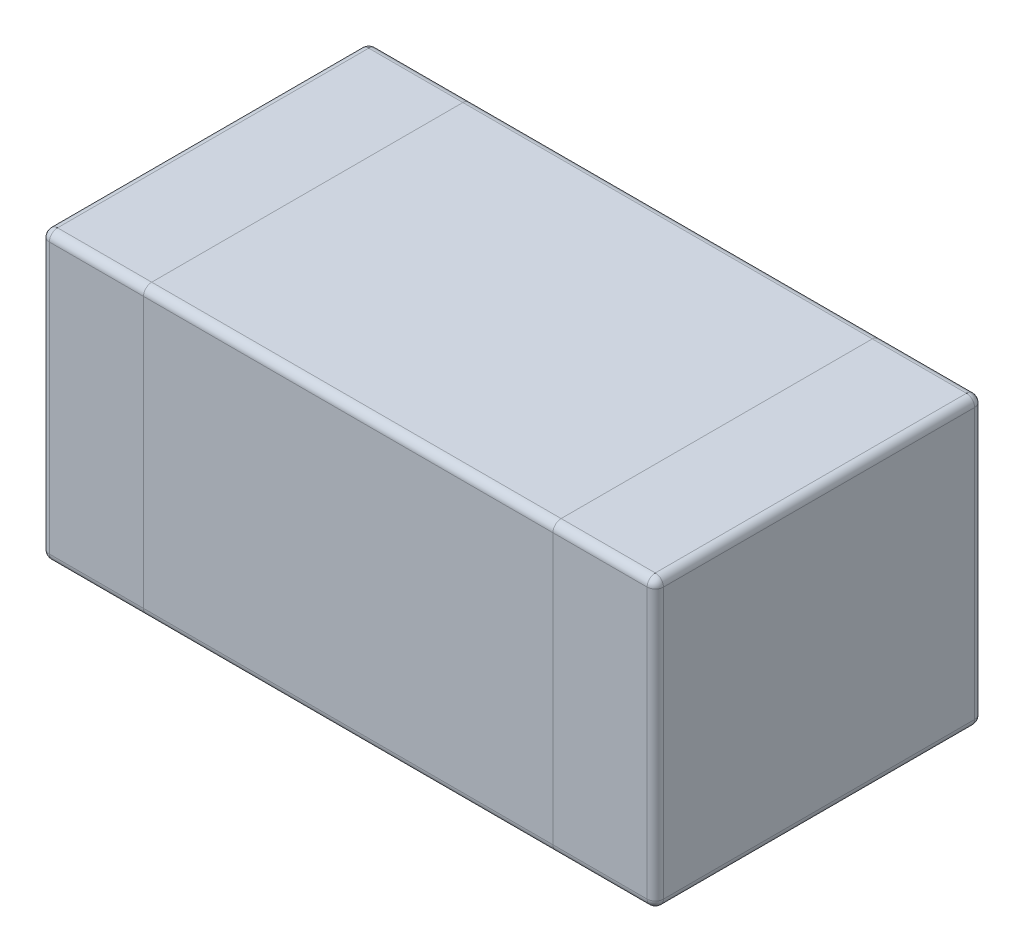
ISO-10303-21;
HEADER;
FILE_DESCRIPTION(('STEP AP214'),'2;1');
FILE_NAME('part.step','',(''),(''),'','','');
FILE_SCHEMA(('AUTOMOTIVE_DESIGN { 1 0 10303 214 1 1 1 1 }'));
ENDSEC;
DATA;
#1=APPLICATION_CONTEXT('core data for automotive mechanical design processes');
#2=APPLICATION_PROTOCOL_DEFINITION('international standard','automotive_design',2000,#1);
#3=PRODUCT_CONTEXT('',#1,'mechanical');
#4=PRODUCT('Part','Part','',(#3));
#5=PRODUCT_RELATED_PRODUCT_CATEGORY('part','',(#4));
#6=PRODUCT_DEFINITION_FORMATION('','',#4);
#7=PRODUCT_DEFINITION_CONTEXT('part definition',#1,'design');
#8=PRODUCT_DEFINITION('design','',#6,#7);
#9=PRODUCT_DEFINITION_SHAPE('','',#8);
#10=(LENGTH_UNIT() NAMED_UNIT(*) SI_UNIT(.MILLI.,.METRE.));
#11=(NAMED_UNIT(*) PLANE_ANGLE_UNIT() SI_UNIT($,.RADIAN.));
#12=(NAMED_UNIT(*) SI_UNIT($,.STERADIAN.) SOLID_ANGLE_UNIT());
#13=UNCERTAINTY_MEASURE_WITH_UNIT(LENGTH_MEASURE(1.E-05),#10,'distance_accuracy_value','');
#14=(GEOMETRIC_REPRESENTATION_CONTEXT(3) GLOBAL_UNCERTAINTY_ASSIGNED_CONTEXT((#13)) GLOBAL_UNIT_ASSIGNED_CONTEXT((#10,
#11,#12)) REPRESENTATION_CONTEXT('',''));
#15=CARTESIAN_POINT('',(0.,0.,0.));
#16=DIRECTION('',(0.,0.,1.));
#17=DIRECTION('',(1.,0.,0.));
#18=AXIS2_PLACEMENT_3D('',#15,#16,#17);
#19=CARTESIAN_POINT('',(-0.73,-0.35,0.38));
#20=DIRECTION('',(0.,1.,0.));
#21=DIRECTION('',(0.,0.,1.));
#22=AXIS2_PLACEMENT_3D('',#19,#20,#21);
#23=PLANE('',#22);
#24=DIRECTION('',(0.,0.,-1.));
#25=VECTOR('',#24,1.);
#26=CARTESIAN_POINT('',(-0.5,-0.35,0.38));
#27=LINE('',#26,#25);
#28=CARTESIAN_POINT('',(-0.5,-0.35,0.38));
#29=VERTEX_POINT('',#28);
#30=CARTESIAN_POINT('',(-0.5,-0.35,-0.38));
#31=VERTEX_POINT('',#30);
#32=EDGE_CURVE('E209',#29,#31,#27,.T.);
#33=ORIENTED_EDGE('',*,*,#32,.F.);
#34=DIRECTION('',(1.,0.,0.));
#35=VECTOR('',#34,1.);
#36=CARTESIAN_POINT('',(-0.73,-0.35,0.38));
#37=LINE('',#36,#35);
#38=CARTESIAN_POINT('',(-0.73,-0.35,0.38));
#39=VERTEX_POINT('',#38);
#40=EDGE_CURVE('E232',#29,#39,#37,.F.);
#41=ORIENTED_EDGE('',*,*,#40,.T.);
#42=DIRECTION('',(0.,0.,1.));
#43=VECTOR('',#42,1.);
#44=CARTESIAN_POINT('',(-0.73,-0.35,0.38));
#45=LINE('',#44,#43);
#46=CARTESIAN_POINT('',(-0.73,-0.35,-0.38));
#47=VERTEX_POINT('',#46);
#48=EDGE_CURVE('E230',#39,#47,#45,.F.);
#49=ORIENTED_EDGE('',*,*,#48,.T.);
#50=DIRECTION('',(-1.,0.,0.));
#51=VECTOR('',#50,1.);
#52=CARTESIAN_POINT('',(-0.73,-0.35,-0.38));
#53=LINE('',#52,#51);
#54=EDGE_CURVE('E228',#47,#31,#53,.F.);
#55=ORIENTED_EDGE('',*,*,#54,.T.);
#56=EDGE_LOOP('',(#33,#41,#49,#55));
#57=FACE_BOUND('',#56,.T.);
#58=ADVANCED_FACE('F38',(#57),#23,.F.);
#59=DIRECTION('',(0.,0.,-1.));
#60=VECTOR('',#59,1.);
#61=CARTESIAN_POINT('',(0.5,-0.35,0.38));
#62=LINE('',#61,#60);
#63=CARTESIAN_POINT('',(0.5,-0.35,0.38));
#64=VERTEX_POINT('',#63);
#65=CARTESIAN_POINT('',(0.5,-0.35,-0.38));
#66=VERTEX_POINT('',#65);
#67=EDGE_CURVE('E215',#64,#66,#62,.T.);
#68=ORIENTED_EDGE('',*,*,#67,.F.);
#69=DIRECTION('',(1.,0.,0.));
#70=VECTOR('',#69,1.);
#71=CARTESIAN_POINT('',(-0.73,-0.35,0.38));
#72=LINE('',#71,#70);
#73=EDGE_CURVE('E220',#64,#29,#72,.F.);
#74=ORIENTED_EDGE('',*,*,#73,.T.);
#75=ORIENTED_EDGE('',*,*,#32,.T.);
#76=DIRECTION('',(-1.,0.,0.));
#77=VECTOR('',#76,1.);
#78=CARTESIAN_POINT('',(-0.73,-0.35,-0.38));
#79=LINE('',#78,#77);
#80=EDGE_CURVE('E211',#31,#66,#79,.F.);
#81=ORIENTED_EDGE('',*,*,#80,.T.);
#82=EDGE_LOOP('',(#68,#74,#75,#81));
#83=FACE_BOUND('',#82,.T.);
#84=ADVANCED_FACE('F446',(#83),#23,.F.);
#85=CARTESIAN_POINT('',(-0.73,0.35,-0.4));
#86=DIRECTION('',(0.,0.,1.));
#87=DIRECTION('',(1.,0.,0.));
#88=AXIS2_PLACEMENT_3D('',#85,#86,#87);
#89=PLANE('',#88);
#90=DIRECTION('',(0.,-1.,0.));
#91=VECTOR('',#90,1.);
#92=CARTESIAN_POINT('',(0.5,0.35,-0.4));
#93=LINE('',#92,#91);
#94=CARTESIAN_POINT('',(0.5,0.33,-0.4));
#95=VERTEX_POINT('',#94);
#96=CARTESIAN_POINT('',(0.5,-0.33,-0.4));
#97=VERTEX_POINT('',#96);
#98=EDGE_CURVE('E195',#95,#97,#93,.T.);
#99=ORIENTED_EDGE('',*,*,#98,.T.);
#100=DIRECTION('',(-1.,0.,0.));
#101=VECTOR('',#100,1.);
#102=CARTESIAN_POINT('',(-0.73,-0.33,-0.4));
#103=LINE('',#102,#101);
#104=CARTESIAN_POINT('',(-0.5,-0.33,-0.4));
#105=VERTEX_POINT('',#104);
#106=EDGE_CURVE('E252',#97,#105,#103,.T.);
#107=ORIENTED_EDGE('',*,*,#106,.T.);
#108=DIRECTION('',(0.,-1.,0.));
#109=VECTOR('',#108,1.);
#110=CARTESIAN_POINT('',(-0.5,0.35,-0.4));
#111=LINE('',#110,#109);
#112=CARTESIAN_POINT('',(-0.5,0.33,-0.4));
#113=VERTEX_POINT('',#112);
#114=EDGE_CURVE('E402',#113,#105,#111,.T.);
#115=ORIENTED_EDGE('',*,*,#114,.F.);
#116=DIRECTION('',(-1.,0.,0.));
#117=VECTOR('',#116,1.);
#118=CARTESIAN_POINT('',(0.5,0.33,-0.4));
#119=LINE('',#118,#117);
#120=EDGE_CURVE('E250',#113,#95,#119,.F.);
#121=ORIENTED_EDGE('',*,*,#120,.T.);
#122=EDGE_LOOP('',(#99,#107,#115,#121));
#123=FACE_BOUND('',#122,.T.);
#124=ADVANCED_FACE('F507',(#123),#89,.F.);
#125=DIRECTION('',(0.,-1.,0.));
#126=VECTOR('',#125,1.);
#127=CARTESIAN_POINT('',(0.73,0.35,-0.4));
#128=LINE('',#127,#126);
#129=CARTESIAN_POINT('',(0.73,0.33,-0.4));
#130=VERTEX_POINT('',#129);
#131=CARTESIAN_POINT('',(0.73,-0.33,-0.4));
#132=VERTEX_POINT('',#131);
#133=EDGE_CURVE('E367',#130,#132,#128,.T.);
#134=ORIENTED_EDGE('',*,*,#133,.T.);
#135=DIRECTION('',(-1.,0.,0.));
#136=VECTOR('',#135,1.);
#137=CARTESIAN_POINT('',(-0.73,-0.33,-0.4));
#138=LINE('',#137,#136);
#139=EDGE_CURVE('E256',#132,#97,#138,.T.);
#140=ORIENTED_EDGE('',*,*,#139,.T.);
#141=ORIENTED_EDGE('',*,*,#98,.F.);
#142=DIRECTION('',(-1.,0.,0.));
#143=VECTOR('',#142,1.);
#144=CARTESIAN_POINT('',(0.73,0.33,-0.4));
#145=LINE('',#144,#143);
#146=EDGE_CURVE('E254',#95,#130,#145,.F.);
#147=ORIENTED_EDGE('',*,*,#146,.T.);
#148=EDGE_LOOP('',(#134,#140,#141,#147));
#149=FACE_BOUND('',#148,.T.);
#150=ADVANCED_FACE('F366',(#149),#89,.F.);
#151=CARTESIAN_POINT('',(-0.73,0.35,0.4));
#152=DIRECTION('',(0.,0.,-1.));
#153=DIRECTION('',(-1.,0.,0.));
#154=AXIS2_PLACEMENT_3D('',#151,#152,#153);
#155=PLANE('',#154);
#156=DIRECTION('',(0.,-1.,0.));
#157=VECTOR('',#156,1.);
#158=CARTESIAN_POINT('',(-0.5,0.35,0.4));
#159=LINE('',#158,#157);
#160=CARTESIAN_POINT('',(-0.5,0.33,0.4));
#161=VERTEX_POINT('',#160);
#162=CARTESIAN_POINT('',(-0.5,-0.33,0.4));
#163=VERTEX_POINT('',#162);
#164=EDGE_CURVE('E196',#161,#163,#159,.T.);
#165=ORIENTED_EDGE('',*,*,#164,.T.);
#166=DIRECTION('',(1.,0.,0.));
#167=VECTOR('',#166,1.);
#168=CARTESIAN_POINT('',(-0.73,-0.33,0.4));
#169=LINE('',#168,#167);
#170=CARTESIAN_POINT('',(0.5,-0.33,0.4));
#171=VERTEX_POINT('',#170);
#172=EDGE_CURVE('E193',#163,#171,#169,.T.);
#173=ORIENTED_EDGE('',*,*,#172,.T.);
#174=DIRECTION('',(0.,-1.,0.));
#175=VECTOR('',#174,1.);
#176=CARTESIAN_POINT('',(0.5,0.35,0.4));
#177=LINE('',#176,#175);
#178=CARTESIAN_POINT('',(0.5,0.33,0.4));
#179=VERTEX_POINT('',#178);
#180=EDGE_CURVE('E178',#179,#171,#177,.T.);
#181=ORIENTED_EDGE('',*,*,#180,.F.);
#182=DIRECTION('',(1.,0.,0.));
#183=VECTOR('',#182,1.);
#184=CARTESIAN_POINT('',(-0.5,0.33,0.4));
#185=LINE('',#184,#183);
#186=EDGE_CURVE('E190',#179,#161,#185,.F.);
#187=ORIENTED_EDGE('',*,*,#186,.T.);
#188=EDGE_LOOP('',(#165,#173,#181,#187));
#189=FACE_BOUND('',#188,.T.);
#190=ADVANCED_FACE('F188',(#189),#155,.F.);
#191=DIRECTION('',(0.,-1.,0.));
#192=VECTOR('',#191,1.);
#193=CARTESIAN_POINT('',(-0.73,0.35,0.4));
#194=LINE('',#193,#192);
#195=CARTESIAN_POINT('',(-0.73,0.33,0.4));
#196=VERTEX_POINT('',#195);
#197=CARTESIAN_POINT('',(-0.73,-0.33,0.4));
#198=VERTEX_POINT('',#197);
#199=EDGE_CURVE('E388',#196,#198,#194,.T.);
#200=ORIENTED_EDGE('',*,*,#199,.T.);
#201=DIRECTION('',(1.,0.,0.));
#202=VECTOR('',#201,1.);
#203=CARTESIAN_POINT('',(-0.73,-0.33,0.4));
#204=LINE('',#203,#202);
#205=EDGE_CURVE('E226',#198,#163,#204,.T.);
#206=ORIENTED_EDGE('',*,*,#205,.T.);
#207=ORIENTED_EDGE('',*,*,#164,.F.);
#208=DIRECTION('',(1.,0.,0.));
#209=VECTOR('',#208,1.);
#210=CARTESIAN_POINT('',(-0.73,0.33,0.4));
#211=LINE('',#210,#209);
#212=EDGE_CURVE('E223',#161,#196,#211,.F.);
#213=ORIENTED_EDGE('',*,*,#212,.T.);
#214=EDGE_LOOP('',(#200,#206,#207,#213));
#215=FACE_BOUND('',#214,.T.);
#216=ADVANCED_FACE('F482',(#215),#155,.F.);
#217=CARTESIAN_POINT('',(-0.73,0.35,0.38));
#218=DIRECTION('',(0.,1.,0.));
#219=DIRECTION('',(0.,0.,1.));
#220=AXIS2_PLACEMENT_3D('',#217,#218,#219);
#221=PLANE('',#220);
#222=DIRECTION('',(0.,0.,-1.));
#223=VECTOR('',#222,1.);
#224=CARTESIAN_POINT('',(0.73,0.35,-0.38));
#225=LINE('',#224,#223);
#226=CARTESIAN_POINT('',(0.73,0.35,0.38));
#227=VERTEX_POINT('',#226);
#228=CARTESIAN_POINT('',(0.73,0.35,-0.38));
#229=VERTEX_POINT('',#228);
#230=EDGE_CURVE('E55',#227,#229,#225,.T.);
#231=ORIENTED_EDGE('',*,*,#230,.T.);
#232=DIRECTION('',(-1.,0.,0.));
#233=VECTOR('',#232,1.);
#234=CARTESIAN_POINT('',(0.5,0.35,-0.38));
#235=LINE('',#234,#233);
#236=CARTESIAN_POINT('',(0.5,0.35,-0.38));
#237=VERTEX_POINT('',#236);
#238=EDGE_CURVE('E289',#229,#237,#235,.T.);
#239=ORIENTED_EDGE('',*,*,#238,.T.);
#240=DIRECTION('',(0.,0.,1.));
#241=VECTOR('',#240,1.);
#242=CARTESIAN_POINT('',(0.5,0.35,0.38));
#243=LINE('',#242,#241);
#244=CARTESIAN_POINT('',(0.5,0.35,0.38));
#245=VERTEX_POINT('',#244);
#246=EDGE_CURVE('E395',#237,#245,#243,.T.);
#247=ORIENTED_EDGE('',*,*,#246,.T.);
#248=DIRECTION('',(1.,0.,0.));
#249=VECTOR('',#248,1.);
#250=CARTESIAN_POINT('',(0.73,0.35,0.38));
#251=LINE('',#250,#249);
#252=EDGE_CURVE('E60',#245,#227,#251,.T.);
#253=ORIENTED_EDGE('',*,*,#252,.T.);
#254=EDGE_LOOP('',(#231,#239,#247,#253));
#255=FACE_BOUND('',#254,.T.);
#256=ADVANCED_FACE('F493',(#255),#221,.T.);
#257=ORIENTED_EDGE('',*,*,#246,.F.);
#258=DIRECTION('',(-1.,0.,0.));
#259=VECTOR('',#258,1.);
#260=CARTESIAN_POINT('',(-0.5,0.35,-0.38));
#261=LINE('',#260,#259);
#262=CARTESIAN_POINT('',(-0.5,0.35,-0.38));
#263=VERTEX_POINT('',#262);
#264=EDGE_CURVE('E285',#237,#263,#261,.T.);
#265=ORIENTED_EDGE('',*,*,#264,.T.);
#266=DIRECTION('',(0.,0.,1.));
#267=VECTOR('',#266,1.);
#268=CARTESIAN_POINT('',(-0.5,0.35,0.38));
#269=LINE('',#268,#267);
#270=CARTESIAN_POINT('',(-0.5,0.35,0.38));
#271=VERTEX_POINT('',#270);
#272=EDGE_CURVE('E391',#263,#271,#269,.T.);
#273=ORIENTED_EDGE('',*,*,#272,.T.);
#274=DIRECTION('',(1.,0.,0.));
#275=VECTOR('',#274,1.);
#276=CARTESIAN_POINT('',(0.5,0.35,0.38));
#277=LINE('',#276,#275);
#278=EDGE_CURVE('E283',#271,#245,#277,.T.);
#279=ORIENTED_EDGE('',*,*,#278,.T.);
#280=EDGE_LOOP('',(#257,#265,#273,#279));
#281=FACE_BOUND('',#280,.T.);
#282=ADVANCED_FACE('F492',(#281),#221,.T.);
#283=CARTESIAN_POINT('',(-0.73,0.35,0.38));
#284=DIRECTION('',(0.,-1.,0.));
#285=DIRECTION('',(0.,0.,-1.));
#286=AXIS2_PLACEMENT_3D('',#283,#284,#285);
#287=CYLINDRICAL_SURFACE('',#286,0.02);
#288=DIRECTION('',(0.,-1.,0.));
#289=VECTOR('',#288,1.);
#290=CARTESIAN_POINT('',(-0.75,0.35,0.38));
#291=LINE('',#290,#289);
#292=CARTESIAN_POINT('',(-0.75,0.33,0.38));
#293=VERTEX_POINT('',#292);
#294=CARTESIAN_POINT('',(-0.75,-0.33,0.38));
#295=VERTEX_POINT('',#294);
#296=EDGE_CURVE('E326',#293,#295,#291,.T.);
#297=ORIENTED_EDGE('',*,*,#296,.T.);
#298=CARTESIAN_POINT('',(-0.73,-0.33,0.38));
#299=DIRECTION('',(0.,-1.,0.));
#300=DIRECTION('',(0.,0.,-1.));
#301=AXIS2_PLACEMENT_3D('',#298,#299,#300);
#302=CIRCLE('',#301,0.02);
#303=EDGE_CURVE('E236',#295,#198,#302,.F.);
#304=ORIENTED_EDGE('',*,*,#303,.T.);
#305=ORIENTED_EDGE('',*,*,#199,.F.);
#306=CARTESIAN_POINT('',(-0.73,0.33,0.38));
#307=DIRECTION('',(0.,-1.,0.));
#308=DIRECTION('',(0.,0.,-1.));
#309=AXIS2_PLACEMENT_3D('',#306,#307,#308);
#310=CIRCLE('',#309,0.02);
#311=EDGE_CURVE('E234',#196,#293,#310,.T.);
#312=ORIENTED_EDGE('',*,*,#311,.T.);
#313=EDGE_LOOP('',(#297,#304,#305,#312));
#314=FACE_BOUND('',#313,.T.);
#315=ADVANCED_FACE('F471',(#314),#287,.T.);
#316=DIRECTION('',(0.,-1.,0.));
#317=VECTOR('',#316,1.);
#318=CARTESIAN_POINT('',(0.73,0.35,0.4));
#319=LINE('',#318,#317);
#320=CARTESIAN_POINT('',(0.73,0.33,0.4));
#321=VERTEX_POINT('',#320);
#322=CARTESIAN_POINT('',(0.73,-0.33,0.4));
#323=VERTEX_POINT('',#322);
#324=EDGE_CURVE('E180',#321,#323,#319,.T.);
#325=ORIENTED_EDGE('',*,*,#324,.F.);
#326=DIRECTION('',(1.,0.,0.));
#327=VECTOR('',#326,1.);
#328=CARTESIAN_POINT('',(0.5,0.33,0.4));
#329=LINE('',#328,#327);
#330=EDGE_CURVE('E11',#321,#179,#329,.F.);
#331=ORIENTED_EDGE('',*,*,#330,.T.);
#332=ORIENTED_EDGE('',*,*,#180,.T.);
#333=DIRECTION('',(1.,0.,0.));
#334=VECTOR('',#333,1.);
#335=CARTESIAN_POINT('',(-0.73,-0.33,0.4));
#336=LINE('',#335,#334);
#337=EDGE_CURVE('E47',#171,#323,#336,.T.);
#338=ORIENTED_EDGE('',*,*,#337,.T.);
#339=EDGE_LOOP('',(#325,#331,#332,#338));
#340=FACE_BOUND('',#339,.T.);
#341=ADVANCED_FACE('F177',(#340),#155,.F.);
#342=CARTESIAN_POINT('',(0.73,0.35,0.38));
#343=DIRECTION('',(0.,-1.,0.));
#344=DIRECTION('',(0.,0.,-1.));
#345=AXIS2_PLACEMENT_3D('',#342,#343,#344);
#346=CYLINDRICAL_SURFACE('',#345,0.0200000000000001);
#347=ORIENTED_EDGE('',*,*,#324,.T.);
#348=CARTESIAN_POINT('',(0.73,-0.33,0.38));
#349=DIRECTION('',(0.,-1.,0.));
#350=DIRECTION('',(0.,0.,-1.));
#351=AXIS2_PLACEMENT_3D('',#348,#349,#350);
#352=CIRCLE('',#351,0.0200000000000001);
#353=CARTESIAN_POINT('',(0.75,-0.33,0.38));
#354=VERTEX_POINT('',#353);
#355=EDGE_CURVE('E274',#323,#354,#352,.F.);
#356=ORIENTED_EDGE('',*,*,#355,.T.);
#357=DIRECTION('',(0.,-1.,0.));
#358=VECTOR('',#357,1.);
#359=CARTESIAN_POINT('',(0.75,0.35,0.38));
#360=LINE('',#359,#358);
#361=CARTESIAN_POINT('',(0.75,0.33,0.38));
#362=VERTEX_POINT('',#361);
#363=EDGE_CURVE('E378',#362,#354,#360,.T.);
#364=ORIENTED_EDGE('',*,*,#363,.F.);
#365=CARTESIAN_POINT('',(0.73,0.33,0.38));
#366=DIRECTION('',(0.,-1.,0.));
#367=DIRECTION('',(0.,0.,-1.));
#368=AXIS2_PLACEMENT_3D('',#365,#366,#367);
#369=CIRCLE('',#368,0.0200000000000001);
#370=EDGE_CURVE('E272',#362,#321,#369,.T.);
#371=ORIENTED_EDGE('',*,*,#370,.T.);
#372=EDGE_LOOP('',(#347,#356,#364,#371));
#373=FACE_BOUND('',#372,.T.);
#374=ADVANCED_FACE('F755',(#373),#346,.T.);
#375=CARTESIAN_POINT('',(0.75,0.35,0.38));
#376=DIRECTION('',(-1.,0.,0.));
#377=DIRECTION('',(0.,0.,1.));
#378=AXIS2_PLACEMENT_3D('',#375,#376,#377);
#379=PLANE('',#378);
#380=ORIENTED_EDGE('',*,*,#363,.T.);
#381=DIRECTION('',(0.,0.,-1.));
#382=VECTOR('',#381,1.);
#383=CARTESIAN_POINT('',(0.75,-0.33,0.38));
#384=LINE('',#383,#382);
#385=CARTESIAN_POINT('',(0.75,-0.33,-0.38));
#386=VERTEX_POINT('',#385);
#387=EDGE_CURVE('E270',#354,#386,#384,.T.);
#388=ORIENTED_EDGE('',*,*,#387,.T.);
#389=DIRECTION('',(0.,-1.,0.));
#390=VECTOR('',#389,1.);
#391=CARTESIAN_POINT('',(0.75,0.35,-0.38));
#392=LINE('',#391,#390);
#393=CARTESIAN_POINT('',(0.75,0.33,-0.38));
#394=VERTEX_POINT('',#393);
#395=EDGE_CURVE('E375',#394,#386,#392,.T.);
#396=ORIENTED_EDGE('',*,*,#395,.F.);
#397=DIRECTION('',(0.,0.,-1.));
#398=VECTOR('',#397,1.);
#399=CARTESIAN_POINT('',(0.75,0.33,0.38));
#400=LINE('',#399,#398);
#401=EDGE_CURVE('E268',#394,#362,#400,.F.);
#402=ORIENTED_EDGE('',*,*,#401,.T.);
#403=EDGE_LOOP('',(#380,#388,#396,#402));
#404=FACE_BOUND('',#403,.T.);
#405=ADVANCED_FACE('F746',(#404),#379,.F.);
#406=CARTESIAN_POINT('',(0.73,0.35,-0.38));
#407=DIRECTION('',(0.,-1.,0.));
#408=DIRECTION('',(0.,0.,-1.));
#409=AXIS2_PLACEMENT_3D('',#406,#407,#408);
#410=CYLINDRICAL_SURFACE('',#409,0.0200000000000001);
#411=ORIENTED_EDGE('',*,*,#395,.T.);
#412=CARTESIAN_POINT('',(0.73,-0.33,-0.38));
#413=DIRECTION('',(0.,-1.,0.));
#414=DIRECTION('',(0.,0.,-1.));
#415=AXIS2_PLACEMENT_3D('',#412,#413,#414);
#416=CIRCLE('',#415,0.0200000000000001);
#417=EDGE_CURVE('E266',#386,#132,#416,.F.);
#418=ORIENTED_EDGE('',*,*,#417,.T.);
#419=ORIENTED_EDGE('',*,*,#133,.F.);
#420=CARTESIAN_POINT('',(0.73,0.33,-0.38));
#421=DIRECTION('',(0.,-1.,0.));
#422=DIRECTION('',(0.,0.,-1.));
#423=AXIS2_PLACEMENT_3D('',#420,#421,#422);
#424=CIRCLE('',#423,0.0200000000000001);
#425=EDGE_CURVE('E264',#130,#394,#424,.T.);
#426=ORIENTED_EDGE('',*,*,#425,.T.);
#427=EDGE_LOOP('',(#411,#418,#419,#426));
#428=FACE_BOUND('',#427,.T.);
#429=ADVANCED_FACE('F372',(#428),#410,.T.);
#430=ORIENTED_EDGE('',*,*,#114,.T.);
#431=DIRECTION('',(-1.,0.,0.));
#432=VECTOR('',#431,1.);
#433=CARTESIAN_POINT('',(-0.73,-0.33,-0.4));
#434=LINE('',#433,#432);
#435=CARTESIAN_POINT('',(-0.73,-0.33,-0.4));
#436=VERTEX_POINT('',#435);
#437=EDGE_CURVE('E248',#105,#436,#434,.T.);
#438=ORIENTED_EDGE('',*,*,#437,.T.);
#439=DIRECTION('',(0.,-1.,0.));
#440=VECTOR('',#439,1.);
#441=CARTESIAN_POINT('',(-0.73,0.35,-0.4));
#442=LINE('',#441,#440);
#443=CARTESIAN_POINT('',(-0.73,0.33,-0.4));
#444=VERTEX_POINT('',#443);
#445=EDGE_CURVE('E376',#444,#436,#442,.T.);
#446=ORIENTED_EDGE('',*,*,#445,.F.);
#447=DIRECTION('',(-1.,0.,0.));
#448=VECTOR('',#447,1.);
#449=CARTESIAN_POINT('',(-0.5,0.33,-0.4));
#450=LINE('',#449,#448);
#451=EDGE_CURVE('E246',#444,#113,#450,.F.);
#452=ORIENTED_EDGE('',*,*,#451,.T.);
#453=EDGE_LOOP('',(#430,#438,#446,#452));
#454=FACE_BOUND('',#453,.T.);
#455=ADVANCED_FACE('F727',(#454),#89,.F.);
#456=CARTESIAN_POINT('',(-0.73,0.35,-0.38));
#457=DIRECTION('',(0.,-1.,0.));
#458=DIRECTION('',(0.,0.,-1.));
#459=AXIS2_PLACEMENT_3D('',#456,#457,#458);
#460=CYLINDRICAL_SURFACE('',#459,0.02);
#461=ORIENTED_EDGE('',*,*,#445,.T.);
#462=CARTESIAN_POINT('',(-0.73,-0.33,-0.38));
#463=DIRECTION('',(0.,-1.,0.));
#464=DIRECTION('',(0.,0.,-1.));
#465=AXIS2_PLACEMENT_3D('',#462,#463,#464);
#466=CIRCLE('',#465,0.02);
#467=CARTESIAN_POINT('',(-0.75,-0.33,-0.38));
#468=VERTEX_POINT('',#467);
#469=EDGE_CURVE('E244',#436,#468,#466,.F.);
#470=ORIENTED_EDGE('',*,*,#469,.T.);
#471=DIRECTION('',(0.,-1.,0.));
#472=VECTOR('',#471,1.);
#473=CARTESIAN_POINT('',(-0.75,0.35,-0.38));
#474=LINE('',#473,#472);
#475=CARTESIAN_POINT('',(-0.75,0.33,-0.38));
#476=VERTEX_POINT('',#475);
#477=EDGE_CURVE('E381',#476,#468,#474,.T.);
#478=ORIENTED_EDGE('',*,*,#477,.F.);
#479=CARTESIAN_POINT('',(-0.73,0.33,-0.38));
#480=DIRECTION('',(0.,-1.,0.));
#481=DIRECTION('',(0.,0.,-1.));
#482=AXIS2_PLACEMENT_3D('',#479,#480,#481);
#483=CIRCLE('',#482,0.02);
#484=EDGE_CURVE('E242',#476,#444,#483,.T.);
#485=ORIENTED_EDGE('',*,*,#484,.T.);
#486=EDGE_LOOP('',(#461,#470,#478,#485));
#487=FACE_BOUND('',#486,.T.);
#488=ADVANCED_FACE('F719',(#487),#460,.T.);
#489=CARTESIAN_POINT('',(-0.75,0.35,0.38));
#490=DIRECTION('',(1.,0.,0.));
#491=DIRECTION('',(0.,0.,-1.));
#492=AXIS2_PLACEMENT_3D('',#489,#490,#491);
#493=PLANE('',#492);
#494=ORIENTED_EDGE('',*,*,#477,.T.);
#495=DIRECTION('',(0.,0.,1.));
#496=VECTOR('',#495,1.);
#497=CARTESIAN_POINT('',(-0.75,-0.33,0.38));
#498=LINE('',#497,#496);
#499=EDGE_CURVE('E240',#468,#295,#498,.T.);
#500=ORIENTED_EDGE('',*,*,#499,.T.);
#501=ORIENTED_EDGE('',*,*,#296,.F.);
#502=DIRECTION('',(0.,0.,1.));
#503=VECTOR('',#502,1.);
#504=CARTESIAN_POINT('',(-0.75,0.33,-0.38));
#505=LINE('',#504,#503);
#506=EDGE_CURVE('E238',#293,#476,#505,.F.);
#507=ORIENTED_EDGE('',*,*,#506,.T.);
#508=EDGE_LOOP('',(#494,#500,#501,#507));
#509=FACE_BOUND('',#508,.T.);
#510=ADVANCED_FACE('F467',(#509),#493,.F.);
#511=DIRECTION('',(0.,0.,1.));
#512=VECTOR('',#511,1.);
#513=CARTESIAN_POINT('',(-0.73,0.35,0.38));
#514=LINE('',#513,#512);
#515=CARTESIAN_POINT('',(-0.73,0.35,-0.38));
#516=VERTEX_POINT('',#515);
#517=CARTESIAN_POINT('',(-0.73,0.35,0.38));
#518=VERTEX_POINT('',#517);
#519=EDGE_CURVE('E278',#516,#518,#514,.T.);
#520=ORIENTED_EDGE('',*,*,#519,.T.);
#521=DIRECTION('',(1.,0.,0.));
#522=VECTOR('',#521,1.);
#523=CARTESIAN_POINT('',(-0.5,0.35,0.38));
#524=LINE('',#523,#522);
#525=EDGE_CURVE('E280',#518,#271,#524,.T.);
#526=ORIENTED_EDGE('',*,*,#525,.T.);
#527=ORIENTED_EDGE('',*,*,#272,.F.);
#528=DIRECTION('',(-1.,0.,0.));
#529=VECTOR('',#528,1.);
#530=CARTESIAN_POINT('',(-0.73,0.35,-0.38));
#531=LINE('',#530,#529);
#532=EDGE_CURVE('E276',#263,#516,#531,.T.);
#533=ORIENTED_EDGE('',*,*,#532,.T.);
#534=EDGE_LOOP('',(#520,#526,#527,#533));
#535=FACE_BOUND('',#534,.T.);
#536=ADVANCED_FACE('F488',(#535),#221,.T.);
#537=ORIENTED_EDGE('',*,*,#67,.T.);
#538=DIRECTION('',(-1.,0.,0.));
#539=VECTOR('',#538,1.);
#540=CARTESIAN_POINT('',(-0.73,-0.35,-0.38));
#541=LINE('',#540,#539);
#542=CARTESIAN_POINT('',(0.73,-0.35,-0.38));
#543=VERTEX_POINT('',#542);
#544=EDGE_CURVE('E262',#66,#543,#541,.F.);
#545=ORIENTED_EDGE('',*,*,#544,.T.);
#546=DIRECTION('',(0.,0.,-1.));
#547=VECTOR('',#546,1.);
#548=CARTESIAN_POINT('',(0.73,-0.35,0.38));
#549=LINE('',#548,#547);
#550=CARTESIAN_POINT('',(0.73,-0.35,0.38));
#551=VERTEX_POINT('',#550);
#552=EDGE_CURVE('E260',#543,#551,#549,.F.);
#553=ORIENTED_EDGE('',*,*,#552,.T.);
#554=DIRECTION('',(1.,0.,0.));
#555=VECTOR('',#554,1.);
#556=CARTESIAN_POINT('',(-0.73,-0.35,0.38));
#557=LINE('',#556,#555);
#558=EDGE_CURVE('E258',#551,#64,#557,.F.);
#559=ORIENTED_EDGE('',*,*,#558,.T.);
#560=EDGE_LOOP('',(#537,#545,#553,#559));
#561=FACE_BOUND('',#560,.T.);
#562=ADVANCED_FACE('F412',(#561),#23,.F.);
#563=CARTESIAN_POINT('',(-0.73,-0.33,-0.38));
#564=DIRECTION('',(-1.,0.,0.));
#565=DIRECTION('',(0.,0.,1.));
#566=AXIS2_PLACEMENT_3D('',#563,#564,#565);
#567=CYLINDRICAL_SURFACE('',#566,0.02);
#568=CARTESIAN_POINT('',(0.5,-0.33,-0.38));
#569=DIRECTION('',(1.,0.,0.));
#570=DIRECTION('',(0.,0.,-1.));
#571=AXIS2_PLACEMENT_3D('',#568,#569,#570);
#572=CIRCLE('',#571,0.02);
#573=EDGE_CURVE('E320',#66,#97,#572,.T.);
#574=ORIENTED_EDGE('',*,*,#573,.F.);
#575=ORIENTED_EDGE('',*,*,#80,.F.);
#576=CARTESIAN_POINT('',(-0.5,-0.33,-0.38));
#577=DIRECTION('',(-1.,0.,0.));
#578=DIRECTION('',(0.,0.,1.));
#579=AXIS2_PLACEMENT_3D('',#576,#577,#578);
#580=CIRCLE('',#579,0.02);
#581=EDGE_CURVE('E323',#105,#31,#580,.T.);
#582=ORIENTED_EDGE('',*,*,#581,.F.);
#583=ORIENTED_EDGE('',*,*,#106,.F.);
#584=EDGE_LOOP('',(#574,#575,#582,#583));
#585=FACE_BOUND('',#584,.T.);
#586=ADVANCED_FACE('F421',(#585),#567,.T.);
#587=CARTESIAN_POINT('',(-0.73,-0.33,-0.38));
#588=DIRECTION('',(-1.,0.,0.));
#589=DIRECTION('',(0.,0.,1.));
#590=AXIS2_PLACEMENT_3D('',#587,#588,#589);
#591=CYLINDRICAL_SURFACE('',#590,0.02);
#592=ORIENTED_EDGE('',*,*,#581,.T.);
#593=ORIENTED_EDGE('',*,*,#54,.F.);
#594=CARTESIAN_POINT('',(-0.73,-0.33,-0.38));
#595=DIRECTION('',(-1.,0.,0.));
#596=DIRECTION('',(0.,0.,1.));
#597=AXIS2_PLACEMENT_3D('',#594,#595,#596);
#598=CIRCLE('',#597,0.02);
#599=EDGE_CURVE('E317',#436,#47,#598,.T.);
#600=ORIENTED_EDGE('',*,*,#599,.F.);
#601=ORIENTED_EDGE('',*,*,#437,.F.);
#602=EDGE_LOOP('',(#592,#593,#600,#601));
#603=FACE_BOUND('',#602,.T.);
#604=ADVANCED_FACE('F452',(#603),#591,.T.);
#605=CARTESIAN_POINT('',(-0.73,-0.33,-0.38));
#606=DIRECTION('',(-1.,0.,0.));
#607=DIRECTION('',(0.,0.,1.));
#608=AXIS2_PLACEMENT_3D('',#605,#606,#607);
#609=CYLINDRICAL_SURFACE('',#608,0.02);
#610=ORIENTED_EDGE('',*,*,#573,.T.);
#611=ORIENTED_EDGE('',*,*,#139,.F.);
#612=CARTESIAN_POINT('',(0.73,-0.33,-0.38));
#613=DIRECTION('',(1.,0.,0.));
#614=DIRECTION('',(0.,0.,-1.));
#615=AXIS2_PLACEMENT_3D('',#612,#613,#614);
#616=CIRCLE('',#615,0.02);
#617=EDGE_CURVE('E314',#543,#132,#616,.T.);
#618=ORIENTED_EDGE('',*,*,#617,.F.);
#619=ORIENTED_EDGE('',*,*,#544,.F.);
#620=EDGE_LOOP('',(#610,#611,#618,#619));
#621=FACE_BOUND('',#620,.T.);
#622=ADVANCED_FACE('F424',(#621),#609,.T.);
#623=CARTESIAN_POINT('',(-0.73,-0.33,-0.38));
#624=DIRECTION('',(0.,1.,0.));
#625=DIRECTION('',(0.,0.,1.));
#626=AXIS2_PLACEMENT_3D('',#623,#624,#625);
#627=SPHERICAL_SURFACE('',#626,0.02);
#628=ORIENTED_EDGE('',*,*,#469,.F.);
#629=ORIENTED_EDGE('',*,*,#599,.T.);
#630=CARTESIAN_POINT('',(-0.73,-0.33,-0.38));
#631=DIRECTION('',(0.,0.,1.));
#632=DIRECTION('',(1.,0.,0.));
#633=AXIS2_PLACEMENT_3D('',#630,#631,#632);
#634=CIRCLE('',#633,0.02);
#635=EDGE_CURVE('E311',#468,#47,#634,.T.);
#636=ORIENTED_EDGE('',*,*,#635,.F.);
#637=EDGE_LOOP('',(#628,#629,#636));
#638=FACE_BOUND('',#637,.T.);
#639=ADVANCED_FACE('F457',(#638),#627,.T.);
#640=CARTESIAN_POINT('',(0.73,-0.33,-0.38));
#641=DIRECTION('',(0.,1.,0.));
#642=DIRECTION('',(0.,0.,1.));
#643=AXIS2_PLACEMENT_3D('',#640,#641,#642);
#644=SPHERICAL_SURFACE('',#643,0.02);
#645=ORIENTED_EDGE('',*,*,#617,.T.);
#646=ORIENTED_EDGE('',*,*,#417,.F.);
#647=CARTESIAN_POINT('',(0.73,-0.33,-0.38));
#648=DIRECTION('',(0.,0.,1.));
#649=DIRECTION('',(1.,0.,0.));
#650=AXIS2_PLACEMENT_3D('',#647,#648,#649);
#651=CIRCLE('',#650,0.02);
#652=EDGE_CURVE('E308',#543,#386,#651,.T.);
#653=ORIENTED_EDGE('',*,*,#652,.F.);
#654=EDGE_LOOP('',(#645,#646,#653));
#655=FACE_BOUND('',#654,.T.);
#656=ADVANCED_FACE('F428',(#655),#644,.T.);
#657=CARTESIAN_POINT('',(-0.73,-0.33,0.38));
#658=DIRECTION('',(0.,0.,1.));
#659=DIRECTION('',(1.,0.,0.));
#660=AXIS2_PLACEMENT_3D('',#657,#658,#659);
#661=CYLINDRICAL_SURFACE('',#660,0.02);
#662=ORIENTED_EDGE('',*,*,#635,.T.);
#663=ORIENTED_EDGE('',*,*,#48,.F.);
#664=CARTESIAN_POINT('',(-0.73,-0.33,0.38));
#665=DIRECTION('',(0.,0.,1.));
#666=DIRECTION('',(1.,0.,0.));
#667=AXIS2_PLACEMENT_3D('',#664,#665,#666);
#668=CIRCLE('',#667,0.02);
#669=EDGE_CURVE('E305',#295,#39,#668,.T.);
#670=ORIENTED_EDGE('',*,*,#669,.F.);
#671=ORIENTED_EDGE('',*,*,#499,.F.);
#672=EDGE_LOOP('',(#662,#663,#670,#671));
#673=FACE_BOUND('',#672,.T.);
#674=ADVANCED_FACE('F460',(#673),#661,.T.);
#675=CARTESIAN_POINT('',(0.73,-0.33,0.38));
#676=DIRECTION('',(0.,0.,-1.));
#677=DIRECTION('',(-1.,0.,0.));
#678=AXIS2_PLACEMENT_3D('',#675,#676,#677);
#679=CYLINDRICAL_SURFACE('',#678,0.02);
#680=ORIENTED_EDGE('',*,*,#652,.T.);
#681=ORIENTED_EDGE('',*,*,#387,.F.);
#682=CARTESIAN_POINT('',(0.73,-0.33,0.38));
#683=DIRECTION('',(0.,0.,1.));
#684=DIRECTION('',(1.,0.,0.));
#685=AXIS2_PLACEMENT_3D('',#682,#683,#684);
#686=CIRCLE('',#685,0.02);
#687=EDGE_CURVE('E302',#551,#354,#686,.T.);
#688=ORIENTED_EDGE('',*,*,#687,.F.);
#689=ORIENTED_EDGE('',*,*,#552,.F.);
#690=EDGE_LOOP('',(#680,#681,#688,#689));
#691=FACE_BOUND('',#690,.T.);
#692=ADVANCED_FACE('F432',(#691),#679,.T.);
#693=CARTESIAN_POINT('',(-0.73,-0.33,0.38));
#694=DIRECTION('',(0.,1.,0.));
#695=DIRECTION('',(0.,0.,1.));
#696=AXIS2_PLACEMENT_3D('',#693,#694,#695);
#697=SPHERICAL_SURFACE('',#696,0.02);
#698=ORIENTED_EDGE('',*,*,#303,.F.);
#699=ORIENTED_EDGE('',*,*,#669,.T.);
#700=CARTESIAN_POINT('',(-0.73,-0.33,0.38));
#701=DIRECTION('',(1.,0.,0.));
#702=DIRECTION('',(0.,0.,-1.));
#703=AXIS2_PLACEMENT_3D('',#700,#701,#702);
#704=CIRCLE('',#703,0.02);
#705=EDGE_CURVE('E299',#198,#39,#704,.T.);
#706=ORIENTED_EDGE('',*,*,#705,.F.);
#707=EDGE_LOOP('',(#698,#699,#706));
#708=FACE_BOUND('',#707,.T.);
#709=ADVANCED_FACE('F570',(#708),#697,.T.);
#710=CARTESIAN_POINT('',(0.73,-0.33,0.38));
#711=DIRECTION('',(0.,1.,0.));
#712=DIRECTION('',(0.,0.,1.));
#713=AXIS2_PLACEMENT_3D('',#710,#711,#712);
#714=SPHERICAL_SURFACE('',#713,0.02);
#715=ORIENTED_EDGE('',*,*,#687,.T.);
#716=ORIENTED_EDGE('',*,*,#355,.F.);
#717=CARTESIAN_POINT('',(0.73,-0.33,0.38));
#718=DIRECTION('',(-1.,0.,0.));
#719=DIRECTION('',(0.,0.,1.));
#720=AXIS2_PLACEMENT_3D('',#717,#718,#719);
#721=CIRCLE('',#720,0.02);
#722=EDGE_CURVE('E296',#551,#323,#721,.T.);
#723=ORIENTED_EDGE('',*,*,#722,.F.);
#724=EDGE_LOOP('',(#715,#716,#723));
#725=FACE_BOUND('',#724,.T.);
#726=ADVANCED_FACE('F436',(#725),#714,.T.);
#727=CARTESIAN_POINT('',(-0.73,-0.33,0.38));
#728=DIRECTION('',(1.,0.,0.));
#729=DIRECTION('',(0.,0.,-1.));
#730=AXIS2_PLACEMENT_3D('',#727,#728,#729);
#731=CYLINDRICAL_SURFACE('',#730,0.02);
#732=ORIENTED_EDGE('',*,*,#705,.T.);
#733=ORIENTED_EDGE('',*,*,#40,.F.);
#734=CARTESIAN_POINT('',(-0.5,-0.33,0.38));
#735=DIRECTION('',(1.,0.,0.));
#736=DIRECTION('',(0.,0.,-1.));
#737=AXIS2_PLACEMENT_3D('',#734,#735,#736);
#738=CIRCLE('',#737,0.02);
#739=EDGE_CURVE('E294',#163,#29,#738,.T.);
#740=ORIENTED_EDGE('',*,*,#739,.F.);
#741=ORIENTED_EDGE('',*,*,#205,.F.);
#742=EDGE_LOOP('',(#732,#733,#740,#741));
#743=FACE_BOUND('',#742,.T.);
#744=ADVANCED_FACE('F561',(#743),#731,.T.);
#745=CARTESIAN_POINT('',(-0.73,-0.33,0.38));
#746=DIRECTION('',(1.,0.,0.));
#747=DIRECTION('',(0.,0.,-1.));
#748=AXIS2_PLACEMENT_3D('',#745,#746,#747);
#749=CYLINDRICAL_SURFACE('',#748,0.02);
#750=ORIENTED_EDGE('',*,*,#722,.T.);
#751=ORIENTED_EDGE('',*,*,#337,.F.);
#752=CARTESIAN_POINT('',(0.5,-0.33,0.38));
#753=DIRECTION('',(-1.,0.,0.));
#754=DIRECTION('',(0.,0.,1.));
#755=AXIS2_PLACEMENT_3D('',#752,#753,#754);
#756=CIRCLE('',#755,0.02);
#757=EDGE_CURVE('E292',#64,#171,#756,.T.);
#758=ORIENTED_EDGE('',*,*,#757,.F.);
#759=ORIENTED_EDGE('',*,*,#558,.F.);
#760=EDGE_LOOP('',(#750,#751,#758,#759));
#761=FACE_BOUND('',#760,.T.);
#762=ADVANCED_FACE('F440',(#761),#749,.T.);
#763=CARTESIAN_POINT('',(-0.73,-0.33,0.38));
#764=DIRECTION('',(1.,0.,0.));
#765=DIRECTION('',(0.,0.,-1.));
#766=AXIS2_PLACEMENT_3D('',#763,#764,#765);
#767=CYLINDRICAL_SURFACE('',#766,0.02);
#768=ORIENTED_EDGE('',*,*,#739,.T.);
#769=ORIENTED_EDGE('',*,*,#73,.F.);
#770=ORIENTED_EDGE('',*,*,#757,.T.);
#771=ORIENTED_EDGE('',*,*,#172,.F.);
#772=EDGE_LOOP('',(#768,#769,#770,#771));
#773=FACE_BOUND('',#772,.T.);
#774=ADVANCED_FACE('F442',(#773),#767,.T.);
#775=CARTESIAN_POINT('',(-0.73,0.33,-0.38));
#776=DIRECTION('',(1.,0.,0.));
#777=DIRECTION('',(0.,0.,-1.));
#778=AXIS2_PLACEMENT_3D('',#775,#776,#777);
#779=CYLINDRICAL_SURFACE('',#778,0.02);
#780=CARTESIAN_POINT('',(0.73,0.33,-0.38));
#781=DIRECTION('',(1.,0.,0.));
#782=DIRECTION('',(0.,0.,-1.));
#783=AXIS2_PLACEMENT_3D('',#780,#781,#782);
#784=CIRCLE('',#783,0.02);
#785=EDGE_CURVE('E347',#130,#229,#784,.T.);
#786=ORIENTED_EDGE('',*,*,#785,.F.);
#787=ORIENTED_EDGE('',*,*,#146,.F.);
#788=CARTESIAN_POINT('',(0.5,0.33,-0.38));
#789=DIRECTION('',(-1.,0.,0.));
#790=DIRECTION('',(0.,0.,1.));
#791=AXIS2_PLACEMENT_3D('',#788,#789,#790);
#792=CIRCLE('',#791,0.02);
#793=EDGE_CURVE('E42',#237,#95,#792,.T.);
#794=ORIENTED_EDGE('',*,*,#793,.F.);
#795=ORIENTED_EDGE('',*,*,#238,.F.);
#796=EDGE_LOOP('',(#786,#787,#794,#795));
#797=FACE_BOUND('',#796,.T.);
#798=ADVANCED_FACE('F40',(#797),#779,.T.);
#799=CARTESIAN_POINT('',(-0.73,0.33,-0.38));
#800=DIRECTION('',(1.,0.,0.));
#801=DIRECTION('',(0.,0.,-1.));
#802=AXIS2_PLACEMENT_3D('',#799,#800,#801);
#803=CYLINDRICAL_SURFACE('',#802,0.02);
#804=ORIENTED_EDGE('',*,*,#793,.T.);
#805=ORIENTED_EDGE('',*,*,#120,.F.);
#806=CARTESIAN_POINT('',(-0.5,0.33,-0.38));
#807=DIRECTION('',(-1.,0.,0.));
#808=DIRECTION('',(0.,0.,1.));
#809=AXIS2_PLACEMENT_3D('',#806,#807,#808);
#810=CIRCLE('',#809,0.02);
#811=EDGE_CURVE('E345',#263,#113,#810,.T.);
#812=ORIENTED_EDGE('',*,*,#811,.F.);
#813=ORIENTED_EDGE('',*,*,#264,.F.);
#814=EDGE_LOOP('',(#804,#805,#812,#813));
#815=FACE_BOUND('',#814,.T.);
#816=ADVANCED_FACE('F358',(#815),#803,.T.);
#817=CARTESIAN_POINT('',(0.73,0.33,-0.38));
#818=DIRECTION('',(0.,1.,0.));
#819=DIRECTION('',(0.,0.,1.));
#820=AXIS2_PLACEMENT_3D('',#817,#818,#819);
#821=SPHERICAL_SURFACE('',#820,0.02);
#822=ORIENTED_EDGE('',*,*,#425,.F.);
#823=ORIENTED_EDGE('',*,*,#785,.T.);
#824=CARTESIAN_POINT('',(0.73,0.33,-0.38));
#825=DIRECTION('',(0.,0.,1.));
#826=DIRECTION('',(1.,0.,0.));
#827=AXIS2_PLACEMENT_3D('',#824,#825,#826);
#828=CIRCLE('',#827,0.02);
#829=EDGE_CURVE('E342',#394,#229,#828,.T.);
#830=ORIENTED_EDGE('',*,*,#829,.F.);
#831=EDGE_LOOP('',(#822,#823,#830));
#832=FACE_BOUND('',#831,.T.);
#833=ADVANCED_FACE('F547',(#832),#821,.T.);
#834=CARTESIAN_POINT('',(-0.73,0.33,-0.38));
#835=DIRECTION('',(1.,0.,0.));
#836=DIRECTION('',(0.,0.,-1.));
#837=AXIS2_PLACEMENT_3D('',#834,#835,#836);
#838=CYLINDRICAL_SURFACE('',#837,0.02);
#839=ORIENTED_EDGE('',*,*,#811,.T.);
#840=ORIENTED_EDGE('',*,*,#451,.F.);
#841=CARTESIAN_POINT('',(-0.73,0.33,-0.38));
#842=DIRECTION('',(-1.,0.,0.));
#843=DIRECTION('',(0.,0.,1.));
#844=AXIS2_PLACEMENT_3D('',#841,#842,#843);
#845=CIRCLE('',#844,0.02);
#846=EDGE_CURVE('E339',#516,#444,#845,.T.);
#847=ORIENTED_EDGE('',*,*,#846,.F.);
#848=ORIENTED_EDGE('',*,*,#532,.F.);
#849=EDGE_LOOP('',(#839,#840,#847,#848));
#850=FACE_BOUND('',#849,.T.);
#851=ADVANCED_FACE('F543',(#850),#838,.T.);
#852=CARTESIAN_POINT('',(0.73,0.33,0.38));
#853=DIRECTION('',(0.,0.,1.));
#854=DIRECTION('',(1.,0.,0.));
#855=AXIS2_PLACEMENT_3D('',#852,#853,#854);
#856=CYLINDRICAL_SURFACE('',#855,0.02);
#857=ORIENTED_EDGE('',*,*,#829,.T.);
#858=ORIENTED_EDGE('',*,*,#230,.F.);
#859=CARTESIAN_POINT('',(0.73,0.33,0.38));
#860=DIRECTION('',(0.,0.,1.));
#861=DIRECTION('',(1.,0.,0.));
#862=AXIS2_PLACEMENT_3D('',#859,#860,#861);
#863=CIRCLE('',#862,0.02);
#864=EDGE_CURVE('E336',#362,#227,#863,.T.);
#865=ORIENTED_EDGE('',*,*,#864,.F.);
#866=ORIENTED_EDGE('',*,*,#401,.F.);
#867=EDGE_LOOP('',(#857,#858,#865,#866));
#868=FACE_BOUND('',#867,.T.);
#869=ADVANCED_FACE('F539',(#868),#856,.T.);
#870=CARTESIAN_POINT('',(-0.73,0.33,-0.38));
#871=DIRECTION('',(0.,1.,0.));
#872=DIRECTION('',(0.,0.,1.));
#873=AXIS2_PLACEMENT_3D('',#870,#871,#872);
#874=SPHERICAL_SURFACE('',#873,0.02);
#875=ORIENTED_EDGE('',*,*,#846,.T.);
#876=ORIENTED_EDGE('',*,*,#484,.F.);
#877=CARTESIAN_POINT('',(-0.73,0.33,-0.38));
#878=DIRECTION('',(0.,0.,1.));
#879=DIRECTION('',(1.,0.,0.));
#880=AXIS2_PLACEMENT_3D('',#877,#878,#879);
#881=CIRCLE('',#880,0.02);
#882=EDGE_CURVE('E333',#516,#476,#881,.T.);
#883=ORIENTED_EDGE('',*,*,#882,.F.);
#884=EDGE_LOOP('',(#875,#876,#883));
#885=FACE_BOUND('',#884,.T.);
#886=ADVANCED_FACE('F535',(#885),#874,.T.);
#887=CARTESIAN_POINT('',(0.73,0.33,0.38));
#888=DIRECTION('',(0.,1.,0.));
#889=DIRECTION('',(0.,0.,1.));
#890=AXIS2_PLACEMENT_3D('',#887,#888,#889);
#891=SPHERICAL_SURFACE('',#890,0.02);
#892=ORIENTED_EDGE('',*,*,#370,.F.);
#893=ORIENTED_EDGE('',*,*,#864,.T.);
#894=CARTESIAN_POINT('',(0.73,0.33,0.38));
#895=DIRECTION('',(-1.,0.,0.));
#896=DIRECTION('',(0.,0.,1.));
#897=AXIS2_PLACEMENT_3D('',#894,#895,#896);
#898=CIRCLE('',#897,0.02);
#899=EDGE_CURVE('E331',#321,#227,#898,.T.);
#900=ORIENTED_EDGE('',*,*,#899,.F.);
#901=EDGE_LOOP('',(#892,#893,#900));
#902=FACE_BOUND('',#901,.T.);
#903=ADVANCED_FACE('F531',(#902),#891,.T.);
#904=CARTESIAN_POINT('',(-0.73,0.33,0.38));
#905=DIRECTION('',(0.,0.,-1.));
#906=DIRECTION('',(-1.,0.,0.));
#907=AXIS2_PLACEMENT_3D('',#904,#905,#906);
#908=CYLINDRICAL_SURFACE('',#907,0.02);
#909=ORIENTED_EDGE('',*,*,#882,.T.);
#910=ORIENTED_EDGE('',*,*,#506,.F.);
#911=CARTESIAN_POINT('',(-0.73,0.33,0.38));
#912=DIRECTION('',(0.,0.,1.));
#913=DIRECTION('',(1.,0.,0.));
#914=AXIS2_PLACEMENT_3D('',#911,#912,#913);
#915=CIRCLE('',#914,0.02);
#916=EDGE_CURVE('E203',#518,#293,#915,.T.);
#917=ORIENTED_EDGE('',*,*,#916,.F.);
#918=ORIENTED_EDGE('',*,*,#519,.F.);
#919=EDGE_LOOP('',(#909,#910,#917,#918));
#920=FACE_BOUND('',#919,.T.);
#921=ADVANCED_FACE('F528',(#920),#908,.T.);
#922=CARTESIAN_POINT('',(-0.73,0.33,0.38));
#923=DIRECTION('',(-1.,0.,0.));
#924=DIRECTION('',(0.,0.,1.));
#925=AXIS2_PLACEMENT_3D('',#922,#923,#924);
#926=CYLINDRICAL_SURFACE('',#925,0.02);
#927=ORIENTED_EDGE('',*,*,#899,.T.);
#928=ORIENTED_EDGE('',*,*,#252,.F.);
#929=CARTESIAN_POINT('',(0.5,0.33,0.38));
#930=DIRECTION('',(-1.,0.,0.));
#931=DIRECTION('',(0.,0.,1.));
#932=AXIS2_PLACEMENT_3D('',#929,#930,#931);
#933=CIRCLE('',#932,0.02);
#934=EDGE_CURVE('E199',#179,#245,#933,.T.);
#935=ORIENTED_EDGE('',*,*,#934,.F.);
#936=ORIENTED_EDGE('',*,*,#330,.F.);
#937=EDGE_LOOP('',(#927,#928,#935,#936));
#938=FACE_BOUND('',#937,.T.);
#939=ADVANCED_FACE('F200',(#938),#926,.T.);
#940=CARTESIAN_POINT('',(-0.73,0.33,0.38));
#941=DIRECTION('',(0.,1.,0.));
#942=DIRECTION('',(0.,0.,1.));
#943=AXIS2_PLACEMENT_3D('',#940,#941,#942);
#944=SPHERICAL_SURFACE('',#943,0.02);
#945=ORIENTED_EDGE('',*,*,#916,.T.);
#946=ORIENTED_EDGE('',*,*,#311,.F.);
#947=CARTESIAN_POINT('',(-0.73,0.33,0.38));
#948=DIRECTION('',(1.,0.,0.));
#949=DIRECTION('',(0.,0.,-1.));
#950=AXIS2_PLACEMENT_3D('',#947,#948,#949);
#951=CIRCLE('',#950,0.02);
#952=EDGE_CURVE('E204',#518,#196,#951,.T.);
#953=ORIENTED_EDGE('',*,*,#952,.F.);
#954=EDGE_LOOP('',(#945,#946,#953));
#955=FACE_BOUND('',#954,.T.);
#956=ADVANCED_FACE('F477',(#955),#944,.T.);
#957=CARTESIAN_POINT('',(-0.73,0.33,0.38));
#958=DIRECTION('',(-1.,0.,0.));
#959=DIRECTION('',(0.,0.,1.));
#960=AXIS2_PLACEMENT_3D('',#957,#958,#959);
#961=CYLINDRICAL_SURFACE('',#960,0.02);
#962=ORIENTED_EDGE('',*,*,#934,.T.);
#963=ORIENTED_EDGE('',*,*,#278,.F.);
#964=CARTESIAN_POINT('',(-0.5,0.33,0.38));
#965=DIRECTION('',(-1.,0.,0.));
#966=DIRECTION('',(0.,0.,1.));
#967=AXIS2_PLACEMENT_3D('',#964,#965,#966);
#968=CIRCLE('',#967,0.02);
#969=EDGE_CURVE('E208',#161,#271,#968,.T.);
#970=ORIENTED_EDGE('',*,*,#969,.F.);
#971=ORIENTED_EDGE('',*,*,#186,.F.);
#972=EDGE_LOOP('',(#962,#963,#970,#971));
#973=FACE_BOUND('',#972,.T.);
#974=ADVANCED_FACE('F207',(#973),#961,.T.);
#975=CARTESIAN_POINT('',(-0.73,0.33,0.38));
#976=DIRECTION('',(-1.,0.,0.));
#977=DIRECTION('',(0.,0.,1.));
#978=AXIS2_PLACEMENT_3D('',#975,#976,#977);
#979=CYLINDRICAL_SURFACE('',#978,0.02);
#980=ORIENTED_EDGE('',*,*,#952,.T.);
#981=ORIENTED_EDGE('',*,*,#212,.F.);
#982=ORIENTED_EDGE('',*,*,#969,.T.);
#983=ORIENTED_EDGE('',*,*,#525,.F.);
#984=EDGE_LOOP('',(#980,#981,#982,#983));
#985=FACE_BOUND('',#984,.T.);
#986=ADVANCED_FACE('F485',(#985),#979,.T.);
#987=CLOSED_SHELL('',(#58,#84,#124,#150,#190,#216,#256,#282,#315,#341,#374,#405,#429,#455,#488,
#510,#536,#562,#586,#604,#622,#639,#656,#674,#692,#709,#726,#744,#762,#774,#798,#816,#833,#851,
#869,#886,#903,#921,#939,#956,#974,#986));
#988=MANIFOLD_SOLID_BREP('B2',#987);
#989=ADVANCED_BREP_SHAPE_REPRESENTATION('',(#18,#988),#14);
#990=SHAPE_DEFINITION_REPRESENTATION(#9,#989);
ENDSEC;
END-ISO-10303-21;
